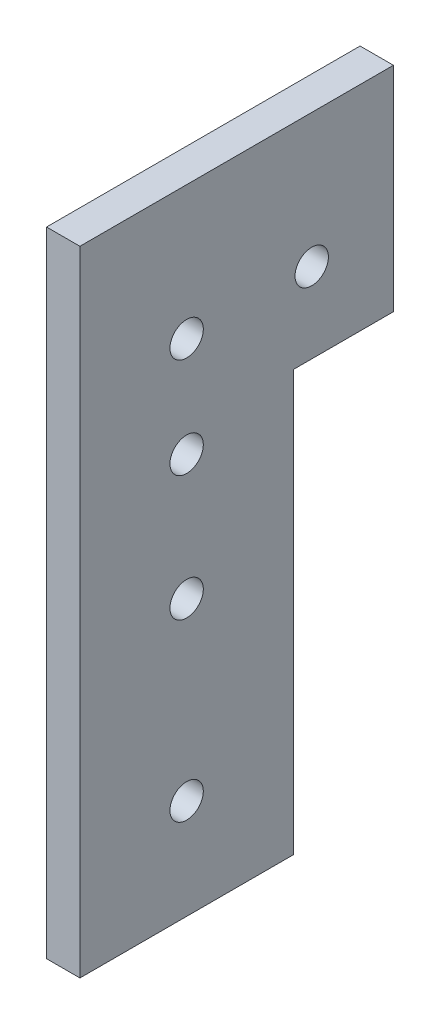
ISO-10303-21;
HEADER;
FILE_DESCRIPTION(('STEP AP214'),'2;1');
FILE_NAME('part.step','',(''),(''),'','','');
FILE_SCHEMA(('AUTOMOTIVE_DESIGN { 1 0 10303 214 1 1 1 1 }'));
ENDSEC;
DATA;
#1=APPLICATION_CONTEXT('core data for automotive mechanical design processes');
#2=APPLICATION_PROTOCOL_DEFINITION('international standard','automotive_design',2000,#1);
#3=PRODUCT_CONTEXT('',#1,'mechanical');
#4=PRODUCT('Part','Part','',(#3));
#5=PRODUCT_RELATED_PRODUCT_CATEGORY('part','',(#4));
#6=PRODUCT_DEFINITION_FORMATION('','',#4);
#7=PRODUCT_DEFINITION_CONTEXT('part definition',#1,'design');
#8=PRODUCT_DEFINITION('design','',#6,#7);
#9=PRODUCT_DEFINITION_SHAPE('','',#8);
#10=(LENGTH_UNIT() NAMED_UNIT(*) SI_UNIT(.MILLI.,.METRE.));
#11=(NAMED_UNIT(*) PLANE_ANGLE_UNIT() SI_UNIT($,.RADIAN.));
#12=(NAMED_UNIT(*) SI_UNIT($,.STERADIAN.) SOLID_ANGLE_UNIT());
#13=UNCERTAINTY_MEASURE_WITH_UNIT(LENGTH_MEASURE(1.E-05),#10,'distance_accuracy_value','');
#14=(GEOMETRIC_REPRESENTATION_CONTEXT(3) GLOBAL_UNCERTAINTY_ASSIGNED_CONTEXT((#13)) GLOBAL_UNIT_ASSIGNED_CONTEXT((#10,
#11,#12)) REPRESENTATION_CONTEXT('',''));
#15=CARTESIAN_POINT('',(0.,0.,0.));
#16=DIRECTION('',(0.,0.,1.));
#17=DIRECTION('',(1.,0.,0.));
#18=AXIS2_PLACEMENT_3D('',#15,#16,#17);
#19=CARTESIAN_POINT('',(6.35,0.,0.));
#20=DIRECTION('',(0.,0.,-1.));
#21=DIRECTION('',(0.,1.,0.));
#22=AXIS2_PLACEMENT_3D('',#19,#20,#21);
#23=PLANE('',#22);
#24=DIRECTION('',(0.,-1.,0.));
#25=VECTOR('',#24,1.);
#26=CARTESIAN_POINT('',(0.,0.,0.));
#27=LINE('',#26,#25);
#28=CARTESIAN_POINT('',(0.,120.65,0.));
#29=VERTEX_POINT('',#28);
#30=CARTESIAN_POINT('',(0.,0.,0.));
#31=VERTEX_POINT('',#30);
#32=EDGE_CURVE('E117',#29,#31,#27,.T.);
#33=ORIENTED_EDGE('',*,*,#32,.T.);
#34=DIRECTION('',(-1.,0.,0.));
#35=VECTOR('',#34,1.);
#36=CARTESIAN_POINT('',(6.35,0.,0.));
#37=LINE('',#36,#35);
#38=CARTESIAN_POINT('',(6.35,0.,0.));
#39=VERTEX_POINT('',#38);
#40=EDGE_CURVE('E11',#39,#31,#37,.T.);
#41=ORIENTED_EDGE('',*,*,#40,.F.);
#42=DIRECTION('',(0.,-1.,0.));
#43=VECTOR('',#42,1.);
#44=CARTESIAN_POINT('',(6.35,0.,0.));
#45=LINE('',#44,#43);
#46=CARTESIAN_POINT('',(6.35,120.65,0.));
#47=VERTEX_POINT('',#46);
#48=EDGE_CURVE('E129',#47,#39,#45,.T.);
#49=ORIENTED_EDGE('',*,*,#48,.F.);
#50=DIRECTION('',(-1.,0.,0.));
#51=VECTOR('',#50,1.);
#52=CARTESIAN_POINT('',(6.35,120.65,0.));
#53=LINE('',#52,#51);
#54=EDGE_CURVE('E113',#47,#29,#53,.T.);
#55=ORIENTED_EDGE('',*,*,#54,.T.);
#56=EDGE_LOOP('',(#33,#41,#49,#55));
#57=FACE_BOUND('',#56,.T.);
#58=ADVANCED_FACE('F32',(#57),#23,.F.);
#59=CARTESIAN_POINT('',(6.35,0.,0.));
#60=DIRECTION('',(0.,1.,0.));
#61=DIRECTION('',(0.,0.,1.));
#62=AXIS2_PLACEMENT_3D('',#59,#60,#61);
#63=PLANE('',#62);
#64=DIRECTION('',(0.,0.,-1.));
#65=VECTOR('',#64,1.);
#66=CARTESIAN_POINT('',(0.,0.,0.));
#67=LINE('',#66,#65);
#68=CARTESIAN_POINT('',(0.,0.,-40.64));
#69=VERTEX_POINT('',#68);
#70=EDGE_CURVE('E120',#31,#69,#67,.T.);
#71=ORIENTED_EDGE('',*,*,#70,.T.);
#72=DIRECTION('',(-1.,0.,0.));
#73=VECTOR('',#72,1.);
#74=CARTESIAN_POINT('',(6.35,0.,-40.64));
#75=LINE('',#74,#73);
#76=CARTESIAN_POINT('',(6.35,0.,-40.64));
#77=VERTEX_POINT('',#76);
#78=EDGE_CURVE('E40',#77,#69,#75,.T.);
#79=ORIENTED_EDGE('',*,*,#78,.F.);
#80=DIRECTION('',(0.,0.,-1.));
#81=VECTOR('',#80,1.);
#82=CARTESIAN_POINT('',(6.35,0.,0.));
#83=LINE('',#82,#81);
#84=EDGE_CURVE('E83',#39,#77,#83,.T.);
#85=ORIENTED_EDGE('',*,*,#84,.F.);
#86=ORIENTED_EDGE('',*,*,#40,.T.);
#87=EDGE_LOOP('',(#71,#79,#85,#86));
#88=FACE_BOUND('',#87,.T.);
#89=ADVANCED_FACE('F209',(#88),#63,.F.);
#90=CARTESIAN_POINT('',(6.35,0.,-40.64));
#91=DIRECTION('',(0.,0.,1.));
#92=DIRECTION('',(0.,-1.,0.));
#93=AXIS2_PLACEMENT_3D('',#90,#91,#92);
#94=PLANE('',#93);
#95=DIRECTION('',(0.,1.,0.));
#96=VECTOR('',#95,1.);
#97=CARTESIAN_POINT('',(0.,0.,-40.64));
#98=LINE('',#97,#96);
#99=CARTESIAN_POINT('',(0.,80.01,-40.64));
#100=VERTEX_POINT('',#99);
#101=EDGE_CURVE('E123',#69,#100,#98,.T.);
#102=ORIENTED_EDGE('',*,*,#101,.T.);
#103=DIRECTION('',(-1.,0.,0.));
#104=VECTOR('',#103,1.);
#105=CARTESIAN_POINT('',(6.35,80.01,-40.64));
#106=LINE('',#105,#104);
#107=CARTESIAN_POINT('',(6.35,80.01,-40.64));
#108=VERTEX_POINT('',#107);
#109=EDGE_CURVE('E108',#108,#100,#106,.T.);
#110=ORIENTED_EDGE('',*,*,#109,.F.);
#111=DIRECTION('',(0.,1.,0.));
#112=VECTOR('',#111,1.);
#113=CARTESIAN_POINT('',(6.35,0.,-40.64));
#114=LINE('',#113,#112);
#115=EDGE_CURVE('E97',#77,#108,#114,.T.);
#116=ORIENTED_EDGE('',*,*,#115,.F.);
#117=ORIENTED_EDGE('',*,*,#78,.T.);
#118=EDGE_LOOP('',(#102,#110,#116,#117));
#119=FACE_BOUND('',#118,.T.);
#120=ADVANCED_FACE('F135',(#119),#94,.F.);
#121=CARTESIAN_POINT('',(6.35,80.01,-40.64));
#122=DIRECTION('',(0.,1.,0.));
#123=DIRECTION('',(0.,0.,1.));
#124=AXIS2_PLACEMENT_3D('',#121,#122,#123);
#125=PLANE('',#124);
#126=DIRECTION('',(0.,0.,-1.));
#127=VECTOR('',#126,1.);
#128=CARTESIAN_POINT('',(0.,80.01,-40.64));
#129=LINE('',#128,#127);
#130=CARTESIAN_POINT('',(0.,80.01,-59.69));
#131=VERTEX_POINT('',#130);
#132=EDGE_CURVE('E106',#100,#131,#129,.T.);
#133=ORIENTED_EDGE('',*,*,#132,.T.);
#134=DIRECTION('',(-1.,0.,0.));
#135=VECTOR('',#134,1.);
#136=CARTESIAN_POINT('',(6.35,80.01,-59.69));
#137=LINE('',#136,#135);
#138=CARTESIAN_POINT('',(6.35,80.01,-59.69));
#139=VERTEX_POINT('',#138);
#140=EDGE_CURVE('E103',#139,#131,#137,.T.);
#141=ORIENTED_EDGE('',*,*,#140,.F.);
#142=DIRECTION('',(0.,0.,-1.));
#143=VECTOR('',#142,1.);
#144=CARTESIAN_POINT('',(6.35,80.01,-40.64));
#145=LINE('',#144,#143);
#146=EDGE_CURVE('E90',#108,#139,#145,.T.);
#147=ORIENTED_EDGE('',*,*,#146,.F.);
#148=ORIENTED_EDGE('',*,*,#109,.T.);
#149=EDGE_LOOP('',(#133,#141,#147,#148));
#150=FACE_BOUND('',#149,.T.);
#151=ADVANCED_FACE('F104',(#150),#125,.F.);
#152=CARTESIAN_POINT('',(6.35,120.65,-59.69));
#153=DIRECTION('',(0.,0.,1.));
#154=DIRECTION('',(0.,-1.,0.));
#155=AXIS2_PLACEMENT_3D('',#152,#153,#154);
#156=PLANE('',#155);
#157=DIRECTION('',(0.,1.,0.));
#158=VECTOR('',#157,1.);
#159=CARTESIAN_POINT('',(0.,120.65,-59.69));
#160=LINE('',#159,#158);
#161=CARTESIAN_POINT('',(0.,120.65,-59.69));
#162=VERTEX_POINT('',#161);
#163=EDGE_CURVE('E126',#131,#162,#160,.T.);
#164=ORIENTED_EDGE('',*,*,#163,.T.);
#165=DIRECTION('',(-1.,0.,0.));
#166=VECTOR('',#165,1.);
#167=CARTESIAN_POINT('',(6.35,120.65,-59.69));
#168=LINE('',#167,#166);
#169=CARTESIAN_POINT('',(6.35,120.65,-59.69));
#170=VERTEX_POINT('',#169);
#171=EDGE_CURVE('E109',#170,#162,#168,.T.);
#172=ORIENTED_EDGE('',*,*,#171,.F.);
#173=DIRECTION('',(0.,1.,0.));
#174=VECTOR('',#173,1.);
#175=CARTESIAN_POINT('',(6.35,120.65,-59.69));
#176=LINE('',#175,#174);
#177=EDGE_CURVE('E94',#139,#170,#176,.T.);
#178=ORIENTED_EDGE('',*,*,#177,.F.);
#179=ORIENTED_EDGE('',*,*,#140,.T.);
#180=EDGE_LOOP('',(#164,#172,#178,#179));
#181=FACE_BOUND('',#180,.T.);
#182=ADVANCED_FACE('F111',(#181),#156,.F.);
#183=CARTESIAN_POINT('',(6.35,120.65,0.));
#184=DIRECTION('',(0.,-1.,0.));
#185=DIRECTION('',(0.,0.,-1.));
#186=AXIS2_PLACEMENT_3D('',#183,#184,#185);
#187=PLANE('',#186);
#188=DIRECTION('',(0.,0.,1.));
#189=VECTOR('',#188,1.);
#190=CARTESIAN_POINT('',(0.,120.65,0.));
#191=LINE('',#190,#189);
#192=EDGE_CURVE('E71',#162,#29,#191,.T.);
#193=ORIENTED_EDGE('',*,*,#192,.T.);
#194=ORIENTED_EDGE('',*,*,#54,.F.);
#195=DIRECTION('',(0.,0.,1.));
#196=VECTOR('',#195,1.);
#197=CARTESIAN_POINT('',(6.35,120.65,-40.64));
#198=LINE('',#197,#196);
#199=EDGE_CURVE('E48',#170,#47,#198,.T.);
#200=ORIENTED_EDGE('',*,*,#199,.F.);
#201=ORIENTED_EDGE('',*,*,#171,.T.);
#202=EDGE_LOOP('',(#193,#194,#200,#201));
#203=FACE_BOUND('',#202,.T.);
#204=ADVANCED_FACE('F137',(#203),#187,.F.);
#205=CARTESIAN_POINT('',(6.35,0.,0.));
#206=DIRECTION('',(-1.,0.,0.));
#207=DIRECTION('',(0.,0.,1.));
#208=AXIS2_PLACEMENT_3D('',#205,#206,#207);
#209=PLANE('',#208);
#210=CARTESIAN_POINT('',(6.35,95.25,-44.1325));
#211=DIRECTION('',(1.,0.,0.));
#212=DIRECTION('',(0.,0.,-1.));
#213=AXIS2_PLACEMENT_3D('',#210,#211,#212);
#214=CIRCLE('',#213,3.175);
#215=CARTESIAN_POINT('',(6.35,95.25,-47.3075));
#216=VERTEX_POINT('',#215);
#217=EDGE_CURVE('E168',#216,#216,#214,.T.);
#218=ORIENTED_EDGE('',*,*,#217,.F.);
#219=EDGE_LOOP('',(#218));
#220=FACE_BOUND('',#219,.T.);
#221=CARTESIAN_POINT('',(6.35,95.25,-20.32));
#222=DIRECTION('',(1.,0.,0.));
#223=DIRECTION('',(0.,0.,-1.));
#224=AXIS2_PLACEMENT_3D('',#221,#222,#223);
#225=CIRCLE('',#224,3.175);
#226=CARTESIAN_POINT('',(6.35,95.25,-23.495));
#227=VERTEX_POINT('',#226);
#228=EDGE_CURVE('E162',#227,#227,#225,.T.);
#229=ORIENTED_EDGE('',*,*,#228,.F.);
#230=EDGE_LOOP('',(#229));
#231=FACE_BOUND('',#230,.T.);
#232=CARTESIAN_POINT('',(6.35,76.2,-20.32));
#233=DIRECTION('',(1.,0.,0.));
#234=DIRECTION('',(0.,0.,-1.));
#235=AXIS2_PLACEMENT_3D('',#232,#233,#234);
#236=CIRCLE('',#235,3.175);
#237=CARTESIAN_POINT('',(6.35,76.2,-23.495));
#238=VERTEX_POINT('',#237);
#239=EDGE_CURVE('E156',#238,#238,#236,.T.);
#240=ORIENTED_EDGE('',*,*,#239,.F.);
#241=EDGE_LOOP('',(#240));
#242=FACE_BOUND('',#241,.T.);
#243=CARTESIAN_POINT('',(6.35,52.3875,-20.32));
#244=DIRECTION('',(1.,0.,0.));
#245=DIRECTION('',(0.,0.,-1.));
#246=AXIS2_PLACEMENT_3D('',#243,#244,#245);
#247=CIRCLE('',#246,3.175);
#248=CARTESIAN_POINT('',(6.35,52.3875,-23.495));
#249=VERTEX_POINT('',#248);
#250=EDGE_CURVE('E150',#249,#249,#247,.T.);
#251=ORIENTED_EDGE('',*,*,#250,.F.);
#252=EDGE_LOOP('',(#251));
#253=FACE_BOUND('',#252,.T.);
#254=CARTESIAN_POINT('',(6.35,19.05,-20.32));
#255=DIRECTION('',(1.,0.,0.));
#256=DIRECTION('',(0.,0.,-1.));
#257=AXIS2_PLACEMENT_3D('',#254,#255,#256);
#258=CIRCLE('',#257,3.175);
#259=CARTESIAN_POINT('',(6.35,19.05,-23.495));
#260=VERTEX_POINT('',#259);
#261=EDGE_CURVE('E144',#260,#260,#258,.T.);
#262=ORIENTED_EDGE('',*,*,#261,.F.);
#263=EDGE_LOOP('',(#262));
#264=FACE_BOUND('',#263,.T.);
#265=ORIENTED_EDGE('',*,*,#48,.T.);
#266=ORIENTED_EDGE('',*,*,#84,.T.);
#267=ORIENTED_EDGE('',*,*,#115,.T.);
#268=ORIENTED_EDGE('',*,*,#146,.T.);
#269=ORIENTED_EDGE('',*,*,#177,.T.);
#270=ORIENTED_EDGE('',*,*,#199,.T.);
#271=EDGE_LOOP('',(#265,#266,#267,#268,#269,#270));
#272=FACE_BOUND('',#271,.T.);
#273=ADVANCED_FACE('F92',(#220,#231,#242,#253,#264,#272),#209,.F.);
#274=CARTESIAN_POINT('',(0.,0.,0.));
#275=DIRECTION('',(-1.,0.,0.));
#276=DIRECTION('',(0.,0.,1.));
#277=AXIS2_PLACEMENT_3D('',#274,#275,#276);
#278=PLANE('',#277);
#279=CARTESIAN_POINT('',(0.,95.25,-44.1325));
#280=DIRECTION('',(1.,0.,0.));
#281=DIRECTION('',(0.,0.,-1.));
#282=AXIS2_PLACEMENT_3D('',#279,#280,#281);
#283=CIRCLE('',#282,3.175);
#284=CARTESIAN_POINT('',(0.,95.25,-47.3075));
#285=VERTEX_POINT('',#284);
#286=EDGE_CURVE('E165',#285,#285,#283,.T.);
#287=ORIENTED_EDGE('',*,*,#286,.T.);
#288=EDGE_LOOP('',(#287));
#289=FACE_BOUND('',#288,.T.);
#290=CARTESIAN_POINT('',(0.,95.25,-20.32));
#291=DIRECTION('',(1.,0.,0.));
#292=DIRECTION('',(0.,0.,-1.));
#293=AXIS2_PLACEMENT_3D('',#290,#291,#292);
#294=CIRCLE('',#293,3.175);
#295=CARTESIAN_POINT('',(0.,95.25,-23.495));
#296=VERTEX_POINT('',#295);
#297=EDGE_CURVE('E159',#296,#296,#294,.T.);
#298=ORIENTED_EDGE('',*,*,#297,.T.);
#299=EDGE_LOOP('',(#298));
#300=FACE_BOUND('',#299,.T.);
#301=CARTESIAN_POINT('',(0.,76.2,-20.32));
#302=DIRECTION('',(1.,0.,0.));
#303=DIRECTION('',(0.,0.,-1.));
#304=AXIS2_PLACEMENT_3D('',#301,#302,#303);
#305=CIRCLE('',#304,3.175);
#306=CARTESIAN_POINT('',(0.,76.2,-23.495));
#307=VERTEX_POINT('',#306);
#308=EDGE_CURVE('E153',#307,#307,#305,.T.);
#309=ORIENTED_EDGE('',*,*,#308,.T.);
#310=EDGE_LOOP('',(#309));
#311=FACE_BOUND('',#310,.T.);
#312=CARTESIAN_POINT('',(0.,52.3875,-20.32));
#313=DIRECTION('',(1.,0.,0.));
#314=DIRECTION('',(0.,0.,-1.));
#315=AXIS2_PLACEMENT_3D('',#312,#313,#314);
#316=CIRCLE('',#315,3.175);
#317=CARTESIAN_POINT('',(0.,52.3875,-23.495));
#318=VERTEX_POINT('',#317);
#319=EDGE_CURVE('E147',#318,#318,#316,.T.);
#320=ORIENTED_EDGE('',*,*,#319,.T.);
#321=EDGE_LOOP('',(#320));
#322=FACE_BOUND('',#321,.T.);
#323=CARTESIAN_POINT('',(0.,19.05,-20.32));
#324=DIRECTION('',(1.,0.,0.));
#325=DIRECTION('',(0.,0.,-1.));
#326=AXIS2_PLACEMENT_3D('',#323,#324,#325);
#327=CIRCLE('',#326,3.175);
#328=CARTESIAN_POINT('',(0.,19.05,-23.495));
#329=VERTEX_POINT('',#328);
#330=EDGE_CURVE('E121',#329,#329,#327,.T.);
#331=ORIENTED_EDGE('',*,*,#330,.T.);
#332=EDGE_LOOP('',(#331));
#333=FACE_BOUND('',#332,.T.);
#334=ORIENTED_EDGE('',*,*,#32,.F.);
#335=ORIENTED_EDGE('',*,*,#192,.F.);
#336=ORIENTED_EDGE('',*,*,#163,.F.);
#337=ORIENTED_EDGE('',*,*,#132,.F.);
#338=ORIENTED_EDGE('',*,*,#101,.F.);
#339=ORIENTED_EDGE('',*,*,#70,.F.);
#340=EDGE_LOOP('',(#334,#335,#336,#337,#338,#339));
#341=FACE_BOUND('',#340,.T.);
#342=ADVANCED_FACE('F136',(#289,#300,#311,#322,#333,#341),#278,.T.);
#343=CARTESIAN_POINT('',(0.,19.05,-20.32));
#344=DIRECTION('',(1.,0.,0.));
#345=DIRECTION('',(0.,0.,-1.));
#346=AXIS2_PLACEMENT_3D('',#343,#344,#345);
#347=CYLINDRICAL_SURFACE('',#346,3.175);
#348=ORIENTED_EDGE('',*,*,#330,.F.);
#349=EDGE_LOOP('',(#348));
#350=FACE_BOUND('',#349,.T.);
#351=ORIENTED_EDGE('',*,*,#261,.T.);
#352=EDGE_LOOP('',(#351));
#353=FACE_BOUND('',#352,.T.);
#354=ADVANCED_FACE('F194',(#350,#353),#347,.F.);
#355=CARTESIAN_POINT('',(0.,52.3875,-20.32));
#356=DIRECTION('',(1.,0.,0.));
#357=DIRECTION('',(0.,0.,-1.));
#358=AXIS2_PLACEMENT_3D('',#355,#356,#357);
#359=CYLINDRICAL_SURFACE('',#358,3.175);
#360=ORIENTED_EDGE('',*,*,#319,.F.);
#361=EDGE_LOOP('',(#360));
#362=FACE_BOUND('',#361,.T.);
#363=ORIENTED_EDGE('',*,*,#250,.T.);
#364=EDGE_LOOP('',(#363));
#365=FACE_BOUND('',#364,.T.);
#366=ADVANCED_FACE('F196',(#362,#365),#359,.F.);
#367=CARTESIAN_POINT('',(0.,76.2,-20.32));
#368=DIRECTION('',(1.,0.,0.));
#369=DIRECTION('',(0.,0.,-1.));
#370=AXIS2_PLACEMENT_3D('',#367,#368,#369);
#371=CYLINDRICAL_SURFACE('',#370,3.175);
#372=ORIENTED_EDGE('',*,*,#308,.F.);
#373=EDGE_LOOP('',(#372));
#374=FACE_BOUND('',#373,.T.);
#375=ORIENTED_EDGE('',*,*,#239,.T.);
#376=EDGE_LOOP('',(#375));
#377=FACE_BOUND('',#376,.T.);
#378=ADVANCED_FACE('F203',(#374,#377),#371,.F.);
#379=CARTESIAN_POINT('',(0.,95.25,-20.32));
#380=DIRECTION('',(1.,0.,0.));
#381=DIRECTION('',(0.,0.,-1.));
#382=AXIS2_PLACEMENT_3D('',#379,#380,#381);
#383=CYLINDRICAL_SURFACE('',#382,3.175);
#384=ORIENTED_EDGE('',*,*,#297,.F.);
#385=EDGE_LOOP('',(#384));
#386=FACE_BOUND('',#385,.T.);
#387=ORIENTED_EDGE('',*,*,#228,.T.);
#388=EDGE_LOOP('',(#387));
#389=FACE_BOUND('',#388,.T.);
#390=ADVANCED_FACE('F179',(#386,#389),#383,.F.);
#391=CARTESIAN_POINT('',(0.,95.25,-44.1325));
#392=DIRECTION('',(1.,0.,0.));
#393=DIRECTION('',(0.,0.,-1.));
#394=AXIS2_PLACEMENT_3D('',#391,#392,#393);
#395=CYLINDRICAL_SURFACE('',#394,3.175);
#396=ORIENTED_EDGE('',*,*,#286,.F.);
#397=EDGE_LOOP('',(#396));
#398=FACE_BOUND('',#397,.T.);
#399=ORIENTED_EDGE('',*,*,#217,.T.);
#400=EDGE_LOOP('',(#399));
#401=FACE_BOUND('',#400,.T.);
#402=ADVANCED_FACE('F176',(#398,#401),#395,.F.);
#403=CLOSED_SHELL('',(#58,#89,#120,#151,#182,#204,#273,#342,#354,#366,#378,#390,#402));
#404=MANIFOLD_SOLID_BREP('B2',#403);
#405=ADVANCED_BREP_SHAPE_REPRESENTATION('',(#18,#404),#14);
#406=SHAPE_DEFINITION_REPRESENTATION(#9,#405);
ENDSEC;
END-ISO-10303-21;
